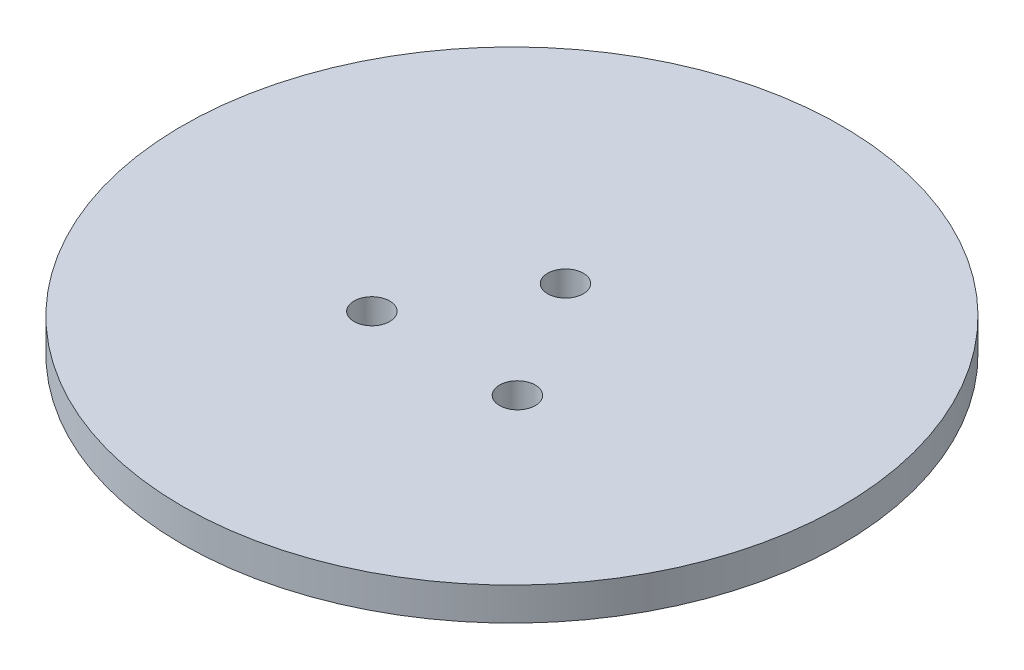
ISO-10303-21;
HEADER;
FILE_DESCRIPTION(('STEP AP214'),'2;1');
FILE_NAME('part.step','',(''),(''),'','','');
FILE_SCHEMA(('AUTOMOTIVE_DESIGN { 1 0 10303 214 1 1 1 1 }'));
ENDSEC;
DATA;
#1=APPLICATION_CONTEXT('core data for automotive mechanical design processes');
#2=APPLICATION_PROTOCOL_DEFINITION('international standard','automotive_design',2000,#1);
#3=PRODUCT_CONTEXT('',#1,'mechanical');
#4=PRODUCT('Part','Part','',(#3));
#5=PRODUCT_RELATED_PRODUCT_CATEGORY('part','',(#4));
#6=PRODUCT_DEFINITION_FORMATION('','',#4);
#7=PRODUCT_DEFINITION_CONTEXT('part definition',#1,'design');
#8=PRODUCT_DEFINITION('design','',#6,#7);
#9=PRODUCT_DEFINITION_SHAPE('','',#8);
#10=(LENGTH_UNIT() NAMED_UNIT(*) SI_UNIT(.MILLI.,.METRE.));
#11=(NAMED_UNIT(*) PLANE_ANGLE_UNIT() SI_UNIT($,.RADIAN.));
#12=(NAMED_UNIT(*) SI_UNIT($,.STERADIAN.) SOLID_ANGLE_UNIT());
#13=UNCERTAINTY_MEASURE_WITH_UNIT(LENGTH_MEASURE(1.E-05),#10,'distance_accuracy_value','');
#14=(GEOMETRIC_REPRESENTATION_CONTEXT(3) GLOBAL_UNCERTAINTY_ASSIGNED_CONTEXT((#13)) GLOBAL_UNIT_ASSIGNED_CONTEXT((#10,
#11,#12)) REPRESENTATION_CONTEXT('',''));
#15=CARTESIAN_POINT('',(0.,0.,0.));
#16=DIRECTION('',(0.,0.,1.));
#17=DIRECTION('',(1.,0.,0.));
#18=AXIS2_PLACEMENT_3D('',#15,#16,#17);
#19=CARTESIAN_POINT('',(-13.7160000000005,-25.4,12.192));
#20=DIRECTION('',(0.,1.,0.));
#21=DIRECTION('',(0.,0.,1.));
#22=AXIS2_PLACEMENT_3D('',#19,#20,#21);
#23=CYLINDRICAL_SURFACE('',#22,3.302);
#24=CARTESIAN_POINT('',(-13.7160000000005,-25.4,12.192));
#25=DIRECTION('',(0.,-1.,0.));
#26=DIRECTION('',(0.,0.,-1.));
#27=AXIS2_PLACEMENT_3D('',#24,#25,#26);
#28=CIRCLE('',#27,3.302);
#29=CARTESIAN_POINT('',(-13.7160000000005,-25.4,8.89));
#30=VERTEX_POINT('',#29);
#31=EDGE_CURVE('E11',#30,#30,#28,.T.);
#32=ORIENTED_EDGE('',*,*,#31,.F.);
#33=EDGE_LOOP('',(#32));
#34=FACE_BOUND('',#33,.T.);
#35=CARTESIAN_POINT('',(-13.7160000000005,0.,12.192));
#36=DIRECTION('',(0.,-1.,0.));
#37=DIRECTION('',(0.,0.,-1.));
#38=AXIS2_PLACEMENT_3D('',#35,#36,#37);
#39=CIRCLE('',#38,3.302);
#40=CARTESIAN_POINT('',(-13.7160000000005,0.,8.89));
#41=VERTEX_POINT('',#40);
#42=EDGE_CURVE('E48',#41,#41,#39,.T.);
#43=ORIENTED_EDGE('',*,*,#42,.T.);
#44=EDGE_LOOP('',(#43));
#45=FACE_BOUND('',#44,.T.);
#46=ADVANCED_FACE('F41',(#34,#45),#23,.T.);
#47=CARTESIAN_POINT('',(-13.7160000000005,-25.4,12.192));
#48=DIRECTION('',(0.,-1.,0.));
#49=DIRECTION('',(0.,0.,-1.));
#50=AXIS2_PLACEMENT_3D('',#47,#48,#49);
#51=PLANE('',#50);
#52=CARTESIAN_POINT('',(-13.7160000000005,-25.4,12.192));
#53=DIRECTION('',(0.,-1.,0.));
#54=DIRECTION('',(0.,0.,-1.));
#55=AXIS2_PLACEMENT_3D('',#52,#53,#54);
#56=CIRCLE('',#55,1.27);
#57=CARTESIAN_POINT('',(-13.7160000000005,-25.4,10.922));
#58=VERTEX_POINT('',#57);
#59=EDGE_CURVE('E54',#58,#58,#56,.T.);
#60=ORIENTED_EDGE('',*,*,#59,.F.);
#61=EDGE_LOOP('',(#60));
#62=FACE_BOUND('',#61,.T.);
#63=ORIENTED_EDGE('',*,*,#31,.T.);
#64=EDGE_LOOP('',(#63));
#65=FACE_BOUND('',#64,.T.);
#66=ADVANCED_FACE('F70',(#62,#65),#51,.T.);
#67=CARTESIAN_POINT('',(-13.7160000000005,0.,12.192));
#68=DIRECTION('',(0.,-1.,0.));
#69=DIRECTION('',(0.,0.,-1.));
#70=AXIS2_PLACEMENT_3D('',#67,#68,#69);
#71=PLANE('',#70);
#72=CARTESIAN_POINT('',(-13.7160000000005,0.,12.192));
#73=DIRECTION('',(0.,-1.,0.));
#74=DIRECTION('',(0.,0.,-1.));
#75=AXIS2_PLACEMENT_3D('',#72,#73,#74);
#76=CIRCLE('',#75,1.27);
#77=CARTESIAN_POINT('',(-13.7160000000005,0.,10.922));
#78=VERTEX_POINT('',#77);
#79=EDGE_CURVE('E44',#78,#78,#76,.T.);
#80=ORIENTED_EDGE('',*,*,#79,.T.);
#81=EDGE_LOOP('',(#80));
#82=FACE_BOUND('',#81,.T.);
#83=ORIENTED_EDGE('',*,*,#42,.F.);
#84=EDGE_LOOP('',(#83));
#85=FACE_BOUND('',#84,.T.);
#86=ADVANCED_FACE('F61',(#82,#85),#71,.F.);
#87=CARTESIAN_POINT('',(-13.7160000000005,6.096,12.192));
#88=DIRECTION('',(0.,-1.,0.));
#89=DIRECTION('',(0.,0.,-1.));
#90=AXIS2_PLACEMENT_3D('',#87,#88,#89);
#91=CYLINDRICAL_SURFACE('',#90,1.27);
#92=ORIENTED_EDGE('',*,*,#59,.T.);
#93=EDGE_LOOP('',(#92));
#94=FACE_BOUND('',#93,.T.);
#95=ORIENTED_EDGE('',*,*,#79,.F.);
#96=EDGE_LOOP('',(#95));
#97=FACE_BOUND('',#96,.T.);
#98=ADVANCED_FACE('F64',(#94,#97),#91,.F.);
#99=CLOSED_SHELL('',(#46,#66,#86,#98));
#100=MANIFOLD_SOLID_BREP('B2',#99);
#101=CARTESIAN_POINT('',(-0.254000000000001,-25.4,-10.16));
#102=DIRECTION('',(0.,1.,0.));
#103=DIRECTION('',(0.,0.,1.));
#104=AXIS2_PLACEMENT_3D('',#101,#102,#103);
#105=CYLINDRICAL_SURFACE('',#104,3.302);
#106=CARTESIAN_POINT('',(-0.254000000000001,-25.4,-10.16));
#107=DIRECTION('',(0.,-1.,0.));
#108=DIRECTION('',(0.,0.,-1.));
#109=AXIS2_PLACEMENT_3D('',#106,#107,#108);
#110=CIRCLE('',#109,3.302);
#111=CARTESIAN_POINT('',(-0.254000000000001,-25.4,-13.462));
#112=VERTEX_POINT('',#111);
#113=EDGE_CURVE('E40',#112,#112,#110,.T.);
#114=ORIENTED_EDGE('',*,*,#113,.F.);
#115=EDGE_LOOP('',(#114));
#116=FACE_BOUND('',#115,.T.);
#117=CARTESIAN_POINT('',(-0.254000000000001,0.,-10.16));
#118=DIRECTION('',(0.,-1.,0.));
#119=DIRECTION('',(0.,0.,-1.));
#120=AXIS2_PLACEMENT_3D('',#117,#118,#119);
#121=CIRCLE('',#120,3.302);
#122=CARTESIAN_POINT('',(-0.254000000000001,0.,-13.462));
#123=VERTEX_POINT('',#122);
#124=EDGE_CURVE('E117',#123,#123,#121,.T.);
#125=ORIENTED_EDGE('',*,*,#124,.T.);
#126=EDGE_LOOP('',(#125));
#127=FACE_BOUND('',#126,.T.);
#128=ADVANCED_FACE('F110',(#116,#127),#105,.T.);
#129=CARTESIAN_POINT('',(-0.254000000000001,-25.4,-10.16));
#130=DIRECTION('',(0.,-1.,0.));
#131=DIRECTION('',(0.,0.,-1.));
#132=AXIS2_PLACEMENT_3D('',#129,#130,#131);
#133=PLANE('',#132);
#134=CARTESIAN_POINT('',(-0.254000000000001,-25.4,-10.16));
#135=DIRECTION('',(0.,-1.,0.));
#136=DIRECTION('',(0.,0.,-1.));
#137=AXIS2_PLACEMENT_3D('',#134,#135,#136);
#138=CIRCLE('',#137,1.27);
#139=CARTESIAN_POINT('',(-0.254000000000001,-25.4,-11.43));
#140=VERTEX_POINT('',#139);
#141=EDGE_CURVE('E123',#140,#140,#138,.T.);
#142=ORIENTED_EDGE('',*,*,#141,.F.);
#143=EDGE_LOOP('',(#142));
#144=FACE_BOUND('',#143,.T.);
#145=ORIENTED_EDGE('',*,*,#113,.T.);
#146=EDGE_LOOP('',(#145));
#147=FACE_BOUND('',#146,.T.);
#148=ADVANCED_FACE('F139',(#144,#147),#133,.T.);
#149=CARTESIAN_POINT('',(-0.254000000000001,0.,-10.16));
#150=DIRECTION('',(0.,-1.,0.));
#151=DIRECTION('',(0.,0.,-1.));
#152=AXIS2_PLACEMENT_3D('',#149,#150,#151);
#153=PLANE('',#152);
#154=CARTESIAN_POINT('',(-0.254000000000001,0.,-10.16));
#155=DIRECTION('',(0.,-1.,0.));
#156=DIRECTION('',(0.,0.,-1.));
#157=AXIS2_PLACEMENT_3D('',#154,#155,#156);
#158=CIRCLE('',#157,1.27);
#159=CARTESIAN_POINT('',(-0.254000000000001,0.,-11.43));
#160=VERTEX_POINT('',#159);
#161=EDGE_CURVE('E113',#160,#160,#158,.T.);
#162=ORIENTED_EDGE('',*,*,#161,.T.);
#163=EDGE_LOOP('',(#162));
#164=FACE_BOUND('',#163,.T.);
#165=ORIENTED_EDGE('',*,*,#124,.F.);
#166=EDGE_LOOP('',(#165));
#167=FACE_BOUND('',#166,.T.);
#168=ADVANCED_FACE('F130',(#164,#167),#153,.F.);
#169=CARTESIAN_POINT('',(-0.254000000000001,6.096,-10.16));
#170=DIRECTION('',(0.,-1.,0.));
#171=DIRECTION('',(0.,0.,-1.));
#172=AXIS2_PLACEMENT_3D('',#169,#170,#171);
#173=CYLINDRICAL_SURFACE('',#172,1.27);
#174=ORIENTED_EDGE('',*,*,#141,.T.);
#175=EDGE_LOOP('',(#174));
#176=FACE_BOUND('',#175,.T.);
#177=ORIENTED_EDGE('',*,*,#161,.F.);
#178=EDGE_LOOP('',(#177));
#179=FACE_BOUND('',#178,.T.);
#180=ADVANCED_FACE('F133',(#176,#179),#173,.F.);
#181=CLOSED_SHELL('',(#128,#148,#168,#180));
#182=MANIFOLD_SOLID_BREP('B6',#181);
#183=CARTESIAN_POINT('',(13.208,-25.4,12.192));
#184=DIRECTION('',(0.,1.,0.));
#185=DIRECTION('',(0.,0.,1.));
#186=AXIS2_PLACEMENT_3D('',#183,#184,#185);
#187=CYLINDRICAL_SURFACE('',#186,3.302);
#188=CARTESIAN_POINT('',(13.208,-25.4,12.192));
#189=DIRECTION('',(0.,-1.,0.));
#190=DIRECTION('',(0.,0.,-1.));
#191=AXIS2_PLACEMENT_3D('',#188,#189,#190);
#192=CIRCLE('',#191,3.302);
#193=CARTESIAN_POINT('',(13.208,-25.4,8.89));
#194=VERTEX_POINT('',#193);
#195=EDGE_CURVE('E109',#194,#194,#192,.T.);
#196=ORIENTED_EDGE('',*,*,#195,.F.);
#197=EDGE_LOOP('',(#196));
#198=FACE_BOUND('',#197,.T.);
#199=CARTESIAN_POINT('',(13.208,0.,12.192));
#200=DIRECTION('',(0.,-1.,0.));
#201=DIRECTION('',(0.,0.,-1.));
#202=AXIS2_PLACEMENT_3D('',#199,#200,#201);
#203=CIRCLE('',#202,3.302);
#204=CARTESIAN_POINT('',(13.208,0.,8.89));
#205=VERTEX_POINT('',#204);
#206=EDGE_CURVE('E185',#205,#205,#203,.T.);
#207=ORIENTED_EDGE('',*,*,#206,.T.);
#208=EDGE_LOOP('',(#207));
#209=FACE_BOUND('',#208,.T.);
#210=ADVANCED_FACE('F178',(#198,#209),#187,.T.);
#211=CARTESIAN_POINT('',(13.208,-25.4,12.192));
#212=DIRECTION('',(0.,-1.,0.));
#213=DIRECTION('',(0.,0.,-1.));
#214=AXIS2_PLACEMENT_3D('',#211,#212,#213);
#215=PLANE('',#214);
#216=CARTESIAN_POINT('',(13.208,-25.4,12.192));
#217=DIRECTION('',(0.,-1.,0.));
#218=DIRECTION('',(0.,0.,-1.));
#219=AXIS2_PLACEMENT_3D('',#216,#217,#218);
#220=CIRCLE('',#219,1.27);
#221=CARTESIAN_POINT('',(13.208,-25.4,10.922));
#222=VERTEX_POINT('',#221);
#223=EDGE_CURVE('E191',#222,#222,#220,.T.);
#224=ORIENTED_EDGE('',*,*,#223,.F.);
#225=EDGE_LOOP('',(#224));
#226=FACE_BOUND('',#225,.T.);
#227=ORIENTED_EDGE('',*,*,#195,.T.);
#228=EDGE_LOOP('',(#227));
#229=FACE_BOUND('',#228,.T.);
#230=ADVANCED_FACE('F207',(#226,#229),#215,.T.);
#231=CARTESIAN_POINT('',(13.208,0.,12.192));
#232=DIRECTION('',(0.,-1.,0.));
#233=DIRECTION('',(0.,0.,-1.));
#234=AXIS2_PLACEMENT_3D('',#231,#232,#233);
#235=PLANE('',#234);
#236=CARTESIAN_POINT('',(13.208,0.,12.192));
#237=DIRECTION('',(0.,-1.,0.));
#238=DIRECTION('',(0.,0.,-1.));
#239=AXIS2_PLACEMENT_3D('',#236,#237,#238);
#240=CIRCLE('',#239,1.27);
#241=CARTESIAN_POINT('',(13.208,0.,10.922));
#242=VERTEX_POINT('',#241);
#243=EDGE_CURVE('E181',#242,#242,#240,.T.);
#244=ORIENTED_EDGE('',*,*,#243,.T.);
#245=EDGE_LOOP('',(#244));
#246=FACE_BOUND('',#245,.T.);
#247=ORIENTED_EDGE('',*,*,#206,.F.);
#248=EDGE_LOOP('',(#247));
#249=FACE_BOUND('',#248,.T.);
#250=ADVANCED_FACE('F198',(#246,#249),#235,.F.);
#251=CARTESIAN_POINT('',(13.208,6.096,12.192));
#252=DIRECTION('',(0.,-1.,0.));
#253=DIRECTION('',(0.,0.,-1.));
#254=AXIS2_PLACEMENT_3D('',#251,#252,#253);
#255=CYLINDRICAL_SURFACE('',#254,1.27);
#256=ORIENTED_EDGE('',*,*,#223,.T.);
#257=EDGE_LOOP('',(#256));
#258=FACE_BOUND('',#257,.T.);
#259=ORIENTED_EDGE('',*,*,#243,.F.);
#260=EDGE_LOOP('',(#259));
#261=FACE_BOUND('',#260,.T.);
#262=ADVANCED_FACE('F201',(#258,#261),#255,.F.);
#263=CLOSED_SHELL('',(#210,#230,#250,#262));
#264=MANIFOLD_SOLID_BREP('B35',#263);
#265=CARTESIAN_POINT('',(0.,6.096,0.));
#266=DIRECTION('',(0.,1.,0.));
#267=DIRECTION('',(0.,0.,1.));
#268=AXIS2_PLACEMENT_3D('',#265,#266,#267);
#269=PLANE('',#268);
#270=CARTESIAN_POINT('',(-13.7160000000005,6.096,12.192));
#271=DIRECTION('',(0.,1.,0.));
#272=DIRECTION('',(0.,0.,1.));
#273=AXIS2_PLACEMENT_3D('',#270,#271,#272);
#274=CIRCLE('',#273,3.302);
#275=CARTESIAN_POINT('',(-13.7160000000005,6.096,15.494));
#276=VERTEX_POINT('',#275);
#277=EDGE_CURVE('E255',#276,#276,#274,.T.);
#278=ORIENTED_EDGE('',*,*,#277,.F.);
#279=EDGE_LOOP('',(#278));
#280=FACE_BOUND('',#279,.T.);
#281=CARTESIAN_POINT('',(0.,6.096,0.));
#282=DIRECTION('',(0.,1.,0.));
#283=DIRECTION('',(0.,0.,1.));
#284=AXIS2_PLACEMENT_3D('',#281,#282,#283);
#285=CIRCLE('',#284,60.96);
#286=CARTESIAN_POINT('',(0.,6.096,60.96));
#287=VERTEX_POINT('',#286);
#288=EDGE_CURVE('E177',#287,#287,#285,.T.);
#289=ORIENTED_EDGE('',*,*,#288,.T.);
#290=EDGE_LOOP('',(#289));
#291=FACE_BOUND('',#290,.T.);
#292=CARTESIAN_POINT('',(-0.254000000000001,6.096,-10.16));
#293=DIRECTION('',(0.,1.,0.));
#294=DIRECTION('',(0.,0.,1.));
#295=AXIS2_PLACEMENT_3D('',#292,#293,#294);
#296=CIRCLE('',#295,3.302);
#297=CARTESIAN_POINT('',(-0.254000000000001,6.096,-6.858));
#298=VERTEX_POINT('',#297);
#299=EDGE_CURVE('E250',#298,#298,#296,.T.);
#300=ORIENTED_EDGE('',*,*,#299,.F.);
#301=EDGE_LOOP('',(#300));
#302=FACE_BOUND('',#301,.T.);
#303=CARTESIAN_POINT('',(13.208,6.096,12.192));
#304=DIRECTION('',(0.,1.,0.));
#305=DIRECTION('',(0.,0.,1.));
#306=AXIS2_PLACEMENT_3D('',#303,#304,#305);
#307=CIRCLE('',#306,3.302);
#308=CARTESIAN_POINT('',(13.208,6.096,15.494));
#309=VERTEX_POINT('',#308);
#310=EDGE_CURVE('E261',#309,#309,#307,.T.);
#311=ORIENTED_EDGE('',*,*,#310,.F.);
#312=EDGE_LOOP('',(#311));
#313=FACE_BOUND('',#312,.T.);
#314=ADVANCED_FACE('F239',(#280,#291,#302,#313),#269,.T.);
#315=CARTESIAN_POINT('',(0.,0.,0.));
#316=DIRECTION('',(0.,1.,0.));
#317=DIRECTION('',(0.,0.,1.));
#318=AXIS2_PLACEMENT_3D('',#315,#316,#317);
#319=PLANE('',#318);
#320=CARTESIAN_POINT('',(-13.7160000000005,0.,12.192));
#321=DIRECTION('',(0.,1.,0.));
#322=DIRECTION('',(0.,0.,1.));
#323=AXIS2_PLACEMENT_3D('',#320,#321,#322);
#324=CIRCLE('',#323,3.302);
#325=CARTESIAN_POINT('',(-13.7160000000005,0.,15.494));
#326=VERTEX_POINT('',#325);
#327=EDGE_CURVE('E258',#326,#326,#324,.T.);
#328=ORIENTED_EDGE('',*,*,#327,.T.);
#329=EDGE_LOOP('',(#328));
#330=FACE_BOUND('',#329,.T.);
#331=CARTESIAN_POINT('',(0.,0.,0.));
#332=DIRECTION('',(0.,1.,0.));
#333=DIRECTION('',(0.,0.,1.));
#334=AXIS2_PLACEMENT_3D('',#331,#332,#333);
#335=CIRCLE('',#334,60.96);
#336=CARTESIAN_POINT('',(0.,0.,60.96));
#337=VERTEX_POINT('',#336);
#338=EDGE_CURVE('E243',#337,#337,#335,.T.);
#339=ORIENTED_EDGE('',*,*,#338,.F.);
#340=EDGE_LOOP('',(#339));
#341=FACE_BOUND('',#340,.T.);
#342=CARTESIAN_POINT('',(-0.254000000000001,0.,-10.16));
#343=DIRECTION('',(0.,1.,0.));
#344=DIRECTION('',(0.,0.,1.));
#345=AXIS2_PLACEMENT_3D('',#342,#343,#344);
#346=CIRCLE('',#345,3.302);
#347=CARTESIAN_POINT('',(-0.254000000000001,0.,-6.858));
#348=VERTEX_POINT('',#347);
#349=EDGE_CURVE('E252',#348,#348,#346,.T.);
#350=ORIENTED_EDGE('',*,*,#349,.T.);
#351=EDGE_LOOP('',(#350));
#352=FACE_BOUND('',#351,.T.);
#353=CARTESIAN_POINT('',(13.208,0.,12.192));
#354=DIRECTION('',(0.,1.,0.));
#355=DIRECTION('',(0.,0.,1.));
#356=AXIS2_PLACEMENT_3D('',#353,#354,#355);
#357=CIRCLE('',#356,3.302);
#358=CARTESIAN_POINT('',(13.208,0.,15.494));
#359=VERTEX_POINT('',#358);
#360=EDGE_CURVE('E264',#359,#359,#357,.T.);
#361=ORIENTED_EDGE('',*,*,#360,.T.);
#362=EDGE_LOOP('',(#361));
#363=FACE_BOUND('',#362,.T.);
#364=ADVANCED_FACE('F274',(#330,#341,#352,#363),#319,.F.);
#365=CARTESIAN_POINT('',(0.,6.096,0.));
#366=DIRECTION('',(0.,-1.,0.));
#367=DIRECTION('',(0.,0.,-1.));
#368=AXIS2_PLACEMENT_3D('',#365,#366,#367);
#369=CYLINDRICAL_SURFACE('',#368,60.96);
#370=ORIENTED_EDGE('',*,*,#288,.F.);
#371=EDGE_LOOP('',(#370));
#372=FACE_BOUND('',#371,.T.);
#373=ORIENTED_EDGE('',*,*,#338,.T.);
#374=EDGE_LOOP('',(#373));
#375=FACE_BOUND('',#374,.T.);
#376=ADVANCED_FACE('F241',(#372,#375),#369,.T.);
#377=CARTESIAN_POINT('',(-0.254000000000001,6.096,-10.16));
#378=DIRECTION('',(0.,-1.,0.));
#379=DIRECTION('',(0.,0.,-1.));
#380=AXIS2_PLACEMENT_3D('',#377,#378,#379);
#381=CYLINDRICAL_SURFACE('',#380,3.302);
#382=ORIENTED_EDGE('',*,*,#299,.T.);
#383=EDGE_LOOP('',(#382));
#384=FACE_BOUND('',#383,.T.);
#385=ORIENTED_EDGE('',*,*,#349,.F.);
#386=EDGE_LOOP('',(#385));
#387=FACE_BOUND('',#386,.T.);
#388=ADVANCED_FACE('F283',(#384,#387),#381,.F.);
#389=CARTESIAN_POINT('',(-13.7160000000005,6.096,12.192));
#390=DIRECTION('',(0.,-1.,0.));
#391=DIRECTION('',(0.,0.,-1.));
#392=AXIS2_PLACEMENT_3D('',#389,#390,#391);
#393=CYLINDRICAL_SURFACE('',#392,3.302);
#394=ORIENTED_EDGE('',*,*,#277,.T.);
#395=EDGE_LOOP('',(#394));
#396=FACE_BOUND('',#395,.T.);
#397=ORIENTED_EDGE('',*,*,#327,.F.);
#398=EDGE_LOOP('',(#397));
#399=FACE_BOUND('',#398,.T.);
#400=ADVANCED_FACE('F286',(#396,#399),#393,.F.);
#401=CARTESIAN_POINT('',(13.208,6.096,12.192));
#402=DIRECTION('',(0.,-1.,0.));
#403=DIRECTION('',(0.,0.,-1.));
#404=AXIS2_PLACEMENT_3D('',#401,#402,#403);
#405=CYLINDRICAL_SURFACE('',#404,3.302);
#406=ORIENTED_EDGE('',*,*,#310,.T.);
#407=EDGE_LOOP('',(#406));
#408=FACE_BOUND('',#407,.T.);
#409=ORIENTED_EDGE('',*,*,#360,.F.);
#410=EDGE_LOOP('',(#409));
#411=FACE_BOUND('',#410,.T.);
#412=ADVANCED_FACE('F270',(#408,#411),#405,.F.);
#413=CLOSED_SHELL('',(#314,#364,#376,#388,#400,#412));
#414=MANIFOLD_SOLID_BREP('B104',#413);
#415=ADVANCED_BREP_SHAPE_REPRESENTATION('',(#18,#100,#182,#264,#414),#14);
#416=SHAPE_DEFINITION_REPRESENTATION(#9,#415);
ENDSEC;
END-ISO-10303-21;
